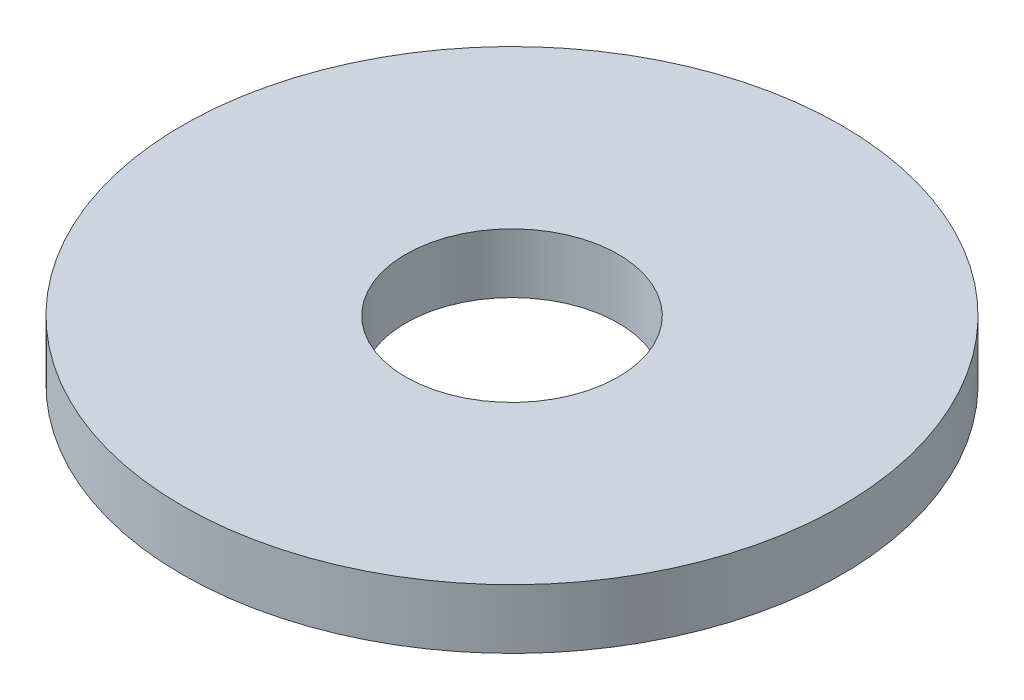
ISO-10303-21;
HEADER;
FILE_DESCRIPTION(('STEP AP214'),'2;1');
FILE_NAME('part.step','',(''),(''),'','','');
FILE_SCHEMA(('AUTOMOTIVE_DESIGN { 1 0 10303 214 1 1 1 1 }'));
ENDSEC;
DATA;
#1=APPLICATION_CONTEXT('core data for automotive mechanical design processes');
#2=APPLICATION_PROTOCOL_DEFINITION('international standard','automotive_design',2000,#1);
#3=PRODUCT_CONTEXT('',#1,'mechanical');
#4=PRODUCT('Part','Part','',(#3));
#5=PRODUCT_RELATED_PRODUCT_CATEGORY('part','',(#4));
#6=PRODUCT_DEFINITION_FORMATION('','',#4);
#7=PRODUCT_DEFINITION_CONTEXT('part definition',#1,'design');
#8=PRODUCT_DEFINITION('design','',#6,#7);
#9=PRODUCT_DEFINITION_SHAPE('','',#8);
#10=(LENGTH_UNIT() NAMED_UNIT(*) SI_UNIT(.MILLI.,.METRE.));
#11=(NAMED_UNIT(*) PLANE_ANGLE_UNIT() SI_UNIT($,.RADIAN.));
#12=(NAMED_UNIT(*) SI_UNIT($,.STERADIAN.) SOLID_ANGLE_UNIT());
#13=UNCERTAINTY_MEASURE_WITH_UNIT(LENGTH_MEASURE(1.E-05),#10,'distance_accuracy_value','');
#14=(GEOMETRIC_REPRESENTATION_CONTEXT(3) GLOBAL_UNCERTAINTY_ASSIGNED_CONTEXT((#13)) GLOBAL_UNIT_ASSIGNED_CONTEXT((#10,
#11,#12)) REPRESENTATION_CONTEXT('',''));
#15=CARTESIAN_POINT('',(0.,0.,0.));
#16=DIRECTION('',(0.,0.,1.));
#17=DIRECTION('',(1.,0.,0.));
#18=AXIS2_PLACEMENT_3D('',#15,#16,#17);
#19=CARTESIAN_POINT('',(0.,14.,0.));
#20=DIRECTION('',(0.,-1.,0.));
#21=DIRECTION('',(0.,0.,-1.));
#22=AXIS2_PLACEMENT_3D('',#19,#20,#21);
#23=CYLINDRICAL_SURFACE('',#22,77.5);
#24=CARTESIAN_POINT('',(0.,14.,0.));
#25=DIRECTION('',(0.,1.,0.));
#26=DIRECTION('',(0.,0.,1.));
#27=AXIS2_PLACEMENT_3D('',#24,#25,#26);
#28=CIRCLE('',#27,77.5);
#29=CARTESIAN_POINT('',(0.,14.,77.5));
#30=VERTEX_POINT('',#29);
#31=EDGE_CURVE('E10',#30,#30,#28,.T.);
#32=ORIENTED_EDGE('',*,*,#31,.F.);
#33=EDGE_LOOP('',(#32));
#34=FACE_BOUND('',#33,.T.);
#35=CARTESIAN_POINT('',(0.,0.,0.));
#36=DIRECTION('',(0.,1.,0.));
#37=DIRECTION('',(0.,0.,1.));
#38=AXIS2_PLACEMENT_3D('',#35,#36,#37);
#39=CIRCLE('',#38,77.5);
#40=CARTESIAN_POINT('',(0.,0.,77.5));
#41=VERTEX_POINT('',#40);
#42=EDGE_CURVE('E37',#41,#41,#39,.T.);
#43=ORIENTED_EDGE('',*,*,#42,.T.);
#44=EDGE_LOOP('',(#43));
#45=FACE_BOUND('',#44,.T.);
#46=ADVANCED_FACE('F40',(#34,#45),#23,.T.);
#47=CARTESIAN_POINT('',(0.,14.,0.));
#48=DIRECTION('',(0.,1.,0.));
#49=DIRECTION('',(0.,0.,1.));
#50=AXIS2_PLACEMENT_3D('',#47,#48,#49);
#51=PLANE('',#50);
#52=CARTESIAN_POINT('',(0.,14.,0.));
#53=DIRECTION('',(0.,1.,0.));
#54=DIRECTION('',(0.,0.,1.));
#55=AXIS2_PLACEMENT_3D('',#52,#53,#54);
#56=CIRCLE('',#55,25.);
#57=CARTESIAN_POINT('',(0.,14.,25.));
#58=VERTEX_POINT('',#57);
#59=EDGE_CURVE('E50',#58,#58,#56,.T.);
#60=ORIENTED_EDGE('',*,*,#59,.F.);
#61=EDGE_LOOP('',(#60));
#62=FACE_BOUND('',#61,.T.);
#63=ORIENTED_EDGE('',*,*,#31,.T.);
#64=EDGE_LOOP('',(#63));
#65=FACE_BOUND('',#64,.T.);
#66=ADVANCED_FACE('F59',(#62,#65),#51,.T.);
#67=CARTESIAN_POINT('',(0.,0.,0.));
#68=DIRECTION('',(0.,1.,0.));
#69=DIRECTION('',(0.,0.,1.));
#70=AXIS2_PLACEMENT_3D('',#67,#68,#69);
#71=PLANE('',#70);
#72=CARTESIAN_POINT('',(0.,0.,0.));
#73=DIRECTION('',(0.,1.,0.));
#74=DIRECTION('',(0.,0.,1.));
#75=AXIS2_PLACEMENT_3D('',#72,#73,#74);
#76=CIRCLE('',#75,25.);
#77=CARTESIAN_POINT('',(0.,0.,25.));
#78=VERTEX_POINT('',#77);
#79=EDGE_CURVE('E47',#78,#78,#76,.T.);
#80=ORIENTED_EDGE('',*,*,#79,.T.);
#81=EDGE_LOOP('',(#80));
#82=FACE_BOUND('',#81,.T.);
#83=ORIENTED_EDGE('',*,*,#42,.F.);
#84=EDGE_LOOP('',(#83));
#85=FACE_BOUND('',#84,.T.);
#86=ADVANCED_FACE('F58',(#82,#85),#71,.F.);
#87=CARTESIAN_POINT('',(0.,14.,0.));
#88=DIRECTION('',(0.,-1.,0.));
#89=DIRECTION('',(0.,0.,-1.));
#90=AXIS2_PLACEMENT_3D('',#87,#88,#89);
#91=CYLINDRICAL_SURFACE('',#90,25.);
#92=ORIENTED_EDGE('',*,*,#59,.T.);
#93=EDGE_LOOP('',(#92));
#94=FACE_BOUND('',#93,.T.);
#95=ORIENTED_EDGE('',*,*,#79,.F.);
#96=EDGE_LOOP('',(#95));
#97=FACE_BOUND('',#96,.T.);
#98=ADVANCED_FACE('F54',(#94,#97),#91,.F.);
#99=CLOSED_SHELL('',(#46,#66,#86,#98));
#100=MANIFOLD_SOLID_BREP('B2',#99);
#101=ADVANCED_BREP_SHAPE_REPRESENTATION('',(#18,#100),#14);
#102=SHAPE_DEFINITION_REPRESENTATION(#9,#101);
ENDSEC;
END-ISO-10303-21;
